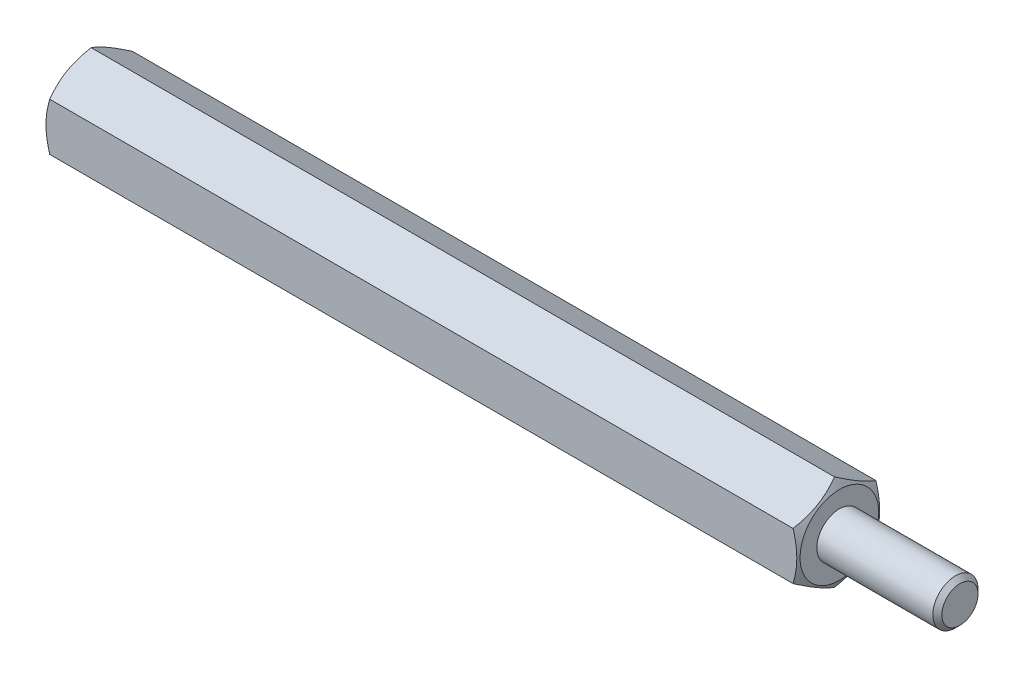
ISO-10303-21;
HEADER;
FILE_DESCRIPTION(('STEP AP214'),'2;1');
FILE_NAME('part.step','',(''),(''),'','','');
FILE_SCHEMA(('AUTOMOTIVE_DESIGN { 1 0 10303 214 1 1 1 1 }'));
ENDSEC;
DATA;
#1=APPLICATION_CONTEXT('core data for automotive mechanical design processes');
#2=APPLICATION_PROTOCOL_DEFINITION('international standard','automotive_design',2000,#1);
#3=PRODUCT_CONTEXT('',#1,'mechanical');
#4=PRODUCT('Part','Part','',(#3));
#5=PRODUCT_RELATED_PRODUCT_CATEGORY('part','',(#4));
#6=PRODUCT_DEFINITION_FORMATION('','',#4);
#7=PRODUCT_DEFINITION_CONTEXT('part definition',#1,'design');
#8=PRODUCT_DEFINITION('design','',#6,#7);
#9=PRODUCT_DEFINITION_SHAPE('','',#8);
#10=(LENGTH_UNIT() NAMED_UNIT(*) SI_UNIT(.MILLI.,.METRE.));
#11=(NAMED_UNIT(*) PLANE_ANGLE_UNIT() SI_UNIT($,.RADIAN.));
#12=(NAMED_UNIT(*) SI_UNIT($,.STERADIAN.) SOLID_ANGLE_UNIT());
#13=UNCERTAINTY_MEASURE_WITH_UNIT(LENGTH_MEASURE(1.E-05),#10,'distance_accuracy_value','');
#14=(GEOMETRIC_REPRESENTATION_CONTEXT(3) GLOBAL_UNCERTAINTY_ASSIGNED_CONTEXT((#13)) GLOBAL_UNIT_ASSIGNED_CONTEXT((#10,
#11,#12)) REPRESENTATION_CONTEXT('',''));
#15=CARTESIAN_POINT('',(0.,0.,0.));
#16=DIRECTION('',(0.,0.,1.));
#17=DIRECTION('',(1.,0.,0.));
#18=AXIS2_PLACEMENT_3D('',#15,#16,#17);
#19=CARTESIAN_POINT('',(50.,0.,0.));
#20=DIRECTION('',(1.,0.,0.));
#21=DIRECTION('',(0.,0.,-1.));
#22=AXIS2_PLACEMENT_3D('',#19,#20,#21);
#23=PLANE('',#22);
#24=CARTESIAN_POINT('',(50.,0.,0.));
#25=DIRECTION('',(1.,0.,0.));
#26=DIRECTION('',(0.,0.,-1.));
#27=AXIS2_PLACEMENT_3D('',#24,#25,#26);
#28=CIRCLE('',#27,1.5);
#29=CARTESIAN_POINT('',(50.,0.,-1.5));
#30=VERTEX_POINT('',#29);
#31=EDGE_CURVE('E120',#30,#30,#28,.T.);
#32=ORIENTED_EDGE('',*,*,#31,.F.);
#33=EDGE_LOOP('',(#32));
#34=FACE_BOUND('',#33,.T.);
#35=CARTESIAN_POINT('',(50.,0.,0.));
#36=DIRECTION('',(1.,0.,0.));
#37=DIRECTION('',(0.,0.,-1.));
#38=AXIS2_PLACEMENT_3D('',#35,#36,#37);
#39=CIRCLE('',#38,2.61250000000001);
#40=CARTESIAN_POINT('',(50.,0.,-2.61250000000001));
#41=VERTEX_POINT('',#40);
#42=EDGE_CURVE('E252',#41,#41,#39,.T.);
#43=ORIENTED_EDGE('',*,*,#42,.T.);
#44=EDGE_LOOP('',(#43));
#45=FACE_BOUND('',#44,.T.);
#46=ADVANCED_FACE('F33',(#34,#45),#23,.T.);
#47=CARTESIAN_POINT('',(58.,0.,0.));
#48=DIRECTION('',(-1.,0.,0.));
#49=DIRECTION('',(0.,0.,1.));
#50=AXIS2_PLACEMENT_3D('',#47,#48,#49);
#51=CYLINDRICAL_SURFACE('',#50,1.5);
#52=CARTESIAN_POINT('',(57.7,0.,0.));
#53=DIRECTION('',(1.,0.,0.));
#54=DIRECTION('',(0.,0.,-1.));
#55=AXIS2_PLACEMENT_3D('',#52,#53,#54);
#56=CIRCLE('',#55,1.5);
#57=CARTESIAN_POINT('',(57.7,0.,-1.5));
#58=VERTEX_POINT('',#57);
#59=EDGE_CURVE('E11',#58,#58,#56,.F.);
#60=ORIENTED_EDGE('',*,*,#59,.T.);
#61=EDGE_LOOP('',(#60));
#62=FACE_BOUND('',#61,.T.);
#63=ORIENTED_EDGE('',*,*,#31,.T.);
#64=EDGE_LOOP('',(#63));
#65=FACE_BOUND('',#64,.T.);
#66=ADVANCED_FACE('F229',(#62,#65),#51,.T.);
#67=CARTESIAN_POINT('',(58.,0.,0.));
#68=DIRECTION('',(1.,0.,0.));
#69=DIRECTION('',(0.,0.,-1.));
#70=AXIS2_PLACEMENT_3D('',#67,#68,#69);
#71=PLANE('',#70);
#72=CARTESIAN_POINT('',(58.,0.,0.));
#73=DIRECTION('',(1.,0.,0.));
#74=DIRECTION('',(0.,0.,-1.));
#75=AXIS2_PLACEMENT_3D('',#72,#73,#74);
#76=CIRCLE('',#75,1.20000000000001);
#77=CARTESIAN_POINT('',(58.,0.,-1.20000000000001));
#78=VERTEX_POINT('',#77);
#79=EDGE_CURVE('E41',#78,#78,#76,.T.);
#80=ORIENTED_EDGE('',*,*,#79,.T.);
#81=EDGE_LOOP('',(#80));
#82=FACE_BOUND('',#81,.T.);
#83=ADVANCED_FACE('F152',(#82),#71,.T.);
#84=CARTESIAN_POINT('',(50.,0.,0.));
#85=DIRECTION('',(-1.,0.,0.));
#86=DIRECTION('',(0.,0.,1.));
#87=AXIS2_PLACEMENT_3D('',#84,#85,#86);
#88=CONICAL_SURFACE('',#87,2.61250000000001,1.0471975511966);
#89=ORIENTED_EDGE('',*,*,#42,.F.);
#90=EDGE_LOOP('',(#89));
#91=FACE_BOUND('',#90,.T.);
#92=CARTESIAN_POINT('',(49.6749275746217,1.58759777021764,-2.7502));
#93=CARTESIAN_POINT('',(49.7152266757372,1.65737010029699,-2.62935077934009));
#94=CARTESIAN_POINT('',(49.7518774353888,1.72774469983534,-2.50745839737736));
#95=CARTESIAN_POINT('',(49.8158521550166,1.86971254687003,-2.2615628732721));
#96=CARTESIAN_POINT('',(49.8431534823119,1.94130831721583,-2.13755536142614));
#97=CARTESIAN_POINT('',(49.8856525926923,2.08361254889599,-1.89107720202405));
#98=CARTESIAN_POINT('',(49.901133219364,2.15429911309864,-1.76864448141258));
#99=CARTESIAN_POINT('',(49.9196149406165,2.29600490065923,-1.52320285763108));
#100=CARTESIAN_POINT('',(49.9226313385238,2.36702360884404,-1.40019484676708));
#101=CARTESIAN_POINT('',(49.9163611925579,2.49972966594897,-1.1703412133892));
#102=CARTESIAN_POINT('',(49.9086141837097,2.56143686540073,-1.06346120874597));
#103=CARTESIAN_POINT('',(49.8840591569221,2.68444923614047,-0.850397532665245));
#104=CARTESIAN_POINT('',(49.8672427483359,2.74575398185008,-0.744214598351105));
#105=CARTESIAN_POINT('',(49.8252024156405,2.86902004703207,-0.530711510606811));
#106=CARTESIAN_POINT('',(49.7998002572992,2.93096576264319,-0.42341838385714));
#107=CARTESIAN_POINT('',(49.7421471121465,3.05393320806134,-0.210432520715945));
#108=CARTESIAN_POINT('',(49.7099096746875,3.11495651365995,-0.104737054973344));
#109=CARTESIAN_POINT('',(49.6749275746217,3.17554195059678,0.000200000000003022));
#110=B_SPLINE_CURVE_WITH_KNOTS('',3,(#92,#93,#94,#95,#96,#97,#98,#99,#100,#101,#102,#103,#104,
#105,#106,#107,#108,#109),.UNSPECIFIED.,.F.,.F.,(4,2,2,2,2,2,2,2,4),(0.,0.435912828725887,
0.872873557116332,1.29901931904671,1.72464171213574,2.09526089052938,2.46622354066374,
2.84541551798557,3.22386274754524),.UNSPECIFIED.);
#111=CARTESIAN_POINT('',(49.6749942449246,1.58771324027148,-2.75));
#112=VERTEX_POINT('',#111);
#113=CARTESIAN_POINT('',(49.6749942449246,3.17542648054294,0.));
#114=VERTEX_POINT('',#113);
#115=EDGE_CURVE('E131',#112,#114,#110,.T.);
#116=ORIENTED_EDGE('',*,*,#115,.T.);
#117=CARTESIAN_POINT('',(49.6749275746217,3.17554195059678,-0.000199999999995645));
#118=CARTESIAN_POINT('',(49.7152266757372,3.10576962051743,0.12064922065991));
#119=CARTESIAN_POINT('',(49.7518774353888,3.03539502097908,0.242541602622638));
#120=CARTESIAN_POINT('',(49.8158521550166,2.89342717394439,0.488437126727897));
#121=CARTESIAN_POINT('',(49.8431534823119,2.82183140359858,0.612444638573861));
#122=CARTESIAN_POINT('',(49.8856525926923,2.67952717191843,0.858922797975949));
#123=CARTESIAN_POINT('',(49.901133219364,2.60884060771577,0.981355518587423));
#124=CARTESIAN_POINT('',(49.9196149406165,2.46713482015519,1.22679714236892));
#125=CARTESIAN_POINT('',(49.9226313385238,2.39611611197038,1.34980515323292));
#126=CARTESIAN_POINT('',(49.9163611925579,2.26341005486544,1.5796587866108));
#127=CARTESIAN_POINT('',(49.9086141837097,2.20170285541369,1.68653879125403));
#128=CARTESIAN_POINT('',(49.8840591569221,2.07869048467395,1.89960246733475));
#129=CARTESIAN_POINT('',(49.8672427483359,2.01738573896434,2.00578540164889));
#130=CARTESIAN_POINT('',(49.8252024156405,1.89411967378235,2.21928848939319));
#131=CARTESIAN_POINT('',(49.7998002572992,1.83217395817123,2.32658161614286));
#132=CARTESIAN_POINT('',(49.7421471121465,1.70920651275308,2.53956747928405));
#133=CARTESIAN_POINT('',(49.7099096746875,1.64818320715446,2.64526294502665));
#134=CARTESIAN_POINT('',(49.6749275746217,1.58759777021764,2.7502));
#135=B_SPLINE_CURVE_WITH_KNOTS('',3,(#117,#118,#119,#120,#121,#122,#123,#124,#125,#126,#127,
#128,#129,#130,#131,#132,#133,#134),.UNSPECIFIED.,.F.,.F.,(4,2,2,2,2,2,2,2,4),(0.,
0.435912828725887,0.872873557116332,1.29901931904672,1.72464171213574,2.09526089052937,
2.46622354066374,2.84541551798557,3.22386274754524),.UNSPECIFIED.);
#136=CARTESIAN_POINT('',(49.6749942449246,1.58771324027147,2.75));
#137=VERTEX_POINT('',#136);
#138=EDGE_CURVE('E139',#114,#137,#135,.T.);
#139=ORIENTED_EDGE('',*,*,#138,.T.);
#140=CARTESIAN_POINT('',(48.5576319326316,-4.30782014241011,2.75));
#141=CARTESIAN_POINT('',(48.6162836095867,-4.18726531654581,2.75));
#142=CARTESIAN_POINT('',(48.6743849240466,-4.06643816910979,2.75));
#143=CARTESIAN_POINT('',(48.7891778669407,-3.8240944166195,2.75));
#144=CARTESIAN_POINT('',(48.8458692806511,-3.70257770996671,2.75));
#145=CARTESIAN_POINT('',(48.9578090560797,-3.458105356063,2.75));
#146=CARTESIAN_POINT('',(49.0130482619427,-3.33514550230564,2.75));
#147=CARTESIAN_POINT('',(49.1213204698911,-3.08826186435015,2.75));
#148=CARTESIAN_POINT('',(49.1743535739049,-2.96433812500113,2.75));
#149=CARTESIAN_POINT('',(49.2792921273943,-2.7113269404381,2.75));
#150=CARTESIAN_POINT('',(49.3311065567683,-2.58220154142924,2.75));
#151=CARTESIAN_POINT('',(49.430916990516,-2.32245648864391,2.75));
#152=CARTESIAN_POINT('',(49.4789125727853,-2.19183667150655,2.75));
#153=CARTESIAN_POINT('',(49.5698579692354,-1.92912498594656,2.75));
#154=CARTESIAN_POINT('',(49.6128175918125,-1.79703654670007,2.75));
#155=CARTESIAN_POINT('',(49.6923417781181,-1.53096629694382,2.75));
#156=CARTESIAN_POINT('',(49.7289083094407,-1.39698508274037,2.75));
#157=CARTESIAN_POINT('',(49.7937438460925,-1.12772708047234,2.75));
#158=CARTESIAN_POINT('',(49.8220547897378,-0.992460577616631,2.75));
#159=CARTESIAN_POINT('',(49.8687813176856,-0.720203153927685,2.75));
#160=CARTESIAN_POINT('',(49.8871980675805,-0.583212438163358,2.75));
#161=CARTESIAN_POINT('',(49.9124291314624,-0.309989978008801,2.75));
#162=CARTESIAN_POINT('',(49.9193954911205,-0.17377262999625,2.75));
#163=CARTESIAN_POINT('',(49.9215379629552,0.0987726794769197,2.75));
#164=CARTESIAN_POINT('',(49.9167134971984,0.235100646032144,2.75));
#165=CARTESIAN_POINT('',(49.8989680753535,0.465158037199999,2.75));
#166=CARTESIAN_POINT('',(49.8889841108657,0.559128814459647,2.75));
#167=CARTESIAN_POINT('',(49.8640111201075,0.746408748148825,2.75));
#168=CARTESIAN_POINT('',(49.8490213815566,0.839717808490765,2.75));
#169=CARTESIAN_POINT('',(49.7973222369876,1.11853931619131,2.75));
#170=CARTESIAN_POINT('',(49.7538938441819,1.30282115121641,2.75));
#171=CARTESIAN_POINT('',(49.6782135831305,1.5786792582721,2.75));
#172=CARTESIAN_POINT('',(49.6508277417716,1.67167174830885,2.75));
#173=CARTESIAN_POINT('',(49.5931453490653,1.85669755112827,2.75));
#174=CARTESIAN_POINT('',(49.562850519184,1.94873139590001,2.75));
#175=CARTESIAN_POINT('',(49.4998214739185,2.13194851920638,2.75));
#176=CARTESIAN_POINT('',(49.4670873446708,2.22313182764733,2.75));
#177=CARTESIAN_POINT('',(49.3995759688816,2.40475072200258,2.75));
#178=CARTESIAN_POINT('',(49.3647984472483,2.49518620536279,2.75));
#179=CARTESIAN_POINT('',(49.286074979109,2.69425906745494,2.75));
#180=CARTESIAN_POINT('',(49.2417347386106,2.8027401541903,2.75));
#181=CARTESIAN_POINT('',(49.1510337491748,3.01885617108242,2.75));
#182=CARTESIAN_POINT('',(49.1046729095401,3.12649106300008,2.75));
#183=CARTESIAN_POINT('',(48.9631220023641,3.44835421203614,2.75));
#184=CARTESIAN_POINT('',(48.865478930226,3.6615028537882,2.75));
#185=CARTESIAN_POINT('',(48.6657085844919,4.0858235012659,2.75));
#186=CARTESIAN_POINT('',(48.5635786539451,4.29699424346804,2.75));
#187=CARTESIAN_POINT('',(48.3561807980291,4.71779425640231,2.75));
#188=CARTESIAN_POINT('',(48.2509127618966,4.92742347239814,2.75));
#189=CARTESIAN_POINT('',(48.037845903081,5.34602646409933,2.75));
#190=CARTESIAN_POINT('',(47.9300415771346,5.55499742988841,2.75));
#191=CARTESIAN_POINT('',(47.7127213552635,5.97205161125948,2.75));
#192=CARTESIAN_POINT('',(47.6032054225523,6.18013480763858,2.75));
#193=CARTESIAN_POINT('',(47.2728160121337,6.80319050465919,2.75));
#194=CARTESIAN_POINT('',(47.0500134395911,7.21713914846338,2.75));
#195=CARTESIAN_POINT('',(46.6349320787507,7.98131294129821,2.75));
#196=CARTESIAN_POINT('',(46.443091202704,8.33177707266852,2.75));
#197=CARTESIAN_POINT('',(46.0577699675954,9.03185646098385,2.75));
#198=CARTESIAN_POINT('',(45.8642894185863,9.38147161337288,2.75));
#199=CARTESIAN_POINT('',(45.4770176449484,10.0785196333477,2.75));
#200=CARTESIAN_POINT('',(45.2832315222264,10.425955339249,2.75));
#201=CARTESIAN_POINT('',(44.8948017372515,11.1202888046247,2.75));
#202=CARTESIAN_POINT('',(44.7001581879707,11.4671866272798,2.75));
#203=CARTESIAN_POINT('',(44.5052089419494,11.8139117951099,2.75));
#204=B_SPLINE_CURVE_WITH_KNOTS('',3,(#140,#141,#142,#143,#144,#145,#146,#147,#148,#149,#150,
#151,#152,#153,#154,#155,#156,#157,#158,#159,#160,#161,#162,#163,#164,#165,#166,#167,#168,#169,
#170,#171,#172,#173,#174,#175,#176,#177,#178,#179,#180,#181,#182,#183,#184,#185,#186,#187,#188,
#189,#190,#191,#192,#193,#194,#195,#196,#197,#198,#199,#200,#201,#202,#203),.UNSPECIFIED.,.F.,
.F.,(4,2,2,2,2,2,2,2,2,2,2,2,2,2,2,2,2,2,2,2,2,2,2,2,2,2,2,2,2,2,2,4),(0.,0.402200406174207,
0.804461695776018,1.20883826557492,1.61319613116903,2.03054962807289,2.44794919196405,
2.86452179433193,3.28096596207104,3.69525619374118,4.10949760895259,4.51819266601271,
4.92690775587315,5.21027047572885,5.49367353296155,6.06085418548303,6.35165161864581,
6.64227801348786,6.93289415059065,7.22354950196185,7.57510236122624,7.92667101670864,
8.62993150186774,9.333614197965,10.0373217608381,10.7427306430188,11.4481547069671,
12.8584292219797,14.0570297519007,15.255771084781,16.4492444189717,17.6425649463424),.UNSPECIFIED.);
#205=CARTESIAN_POINT('',(49.6749942449246,-1.58771324027147,2.75));
#206=VERTEX_POINT('',#205);
#207=EDGE_CURVE('E179',#137,#206,#204,.F.);
#208=ORIENTED_EDGE('',*,*,#207,.T.);
#209=CARTESIAN_POINT('',(49.6749275746217,-1.58759777021763,2.7502));
#210=CARTESIAN_POINT('',(49.7152266757372,-1.65737010029699,2.62935077934009));
#211=CARTESIAN_POINT('',(49.7518774353888,-1.72774469983533,2.50745839737736));
#212=CARTESIAN_POINT('',(49.8158521550166,-1.86971254687003,2.26156287327211));
#213=CARTESIAN_POINT('',(49.8431534823119,-1.94130831721583,2.13755536142614));
#214=CARTESIAN_POINT('',(49.8856525926923,-2.08361254889599,1.89107720202406));
#215=CARTESIAN_POINT('',(49.901133219364,-2.15429911309864,1.76864448141258));
#216=CARTESIAN_POINT('',(49.9196149406165,-2.29600490065923,1.52320285763108));
#217=CARTESIAN_POINT('',(49.9226313385238,-2.36702360884404,1.40019484676709));
#218=CARTESIAN_POINT('',(49.9163611925579,-2.49972966594897,1.1703412133892));
#219=CARTESIAN_POINT('',(49.9086141837097,-2.56143686540073,1.06346120874598));
#220=CARTESIAN_POINT('',(49.8840591569221,-2.68444923614047,0.850397532665247));
#221=CARTESIAN_POINT('',(49.8672427483359,-2.74575398185008,0.744214598351108));
#222=CARTESIAN_POINT('',(49.8252024156405,-2.86902004703207,0.530711510606812));
#223=CARTESIAN_POINT('',(49.7998002572992,-2.93096576264319,0.423418383857141));
#224=CARTESIAN_POINT('',(49.7421471121465,-3.05393320806134,0.210432520715944));
#225=CARTESIAN_POINT('',(49.7099096746875,-3.11495651365995,0.104737054973342));
#226=CARTESIAN_POINT('',(49.6749275746217,-3.17554195059678,-0.000200000000004793));
#227=B_SPLINE_CURVE_WITH_KNOTS('',3,(#209,#210,#211,#212,#213,#214,#215,#216,#217,#218,#219,
#220,#221,#222,#223,#224,#225,#226),.UNSPECIFIED.,.F.,.F.,(4,2,2,2,2,2,2,2,4),(0.,
0.435912828725886,0.872873557116331,1.29901931904671,1.72464171213574,2.09526089052938,
2.46622354066375,2.84541551798557,3.22386274754525),.UNSPECIFIED.);
#228=CARTESIAN_POINT('',(49.6749942449246,-3.17542648054294,0.));
#229=VERTEX_POINT('',#228);
#230=EDGE_CURVE('E174',#206,#229,#227,.T.);
#231=ORIENTED_EDGE('',*,*,#230,.T.);
#232=CARTESIAN_POINT('',(49.6749275746217,-3.17554195059678,0.000199999999994542));
#233=CARTESIAN_POINT('',(49.7152266757372,-3.10576962051743,-0.120649220659911));
#234=CARTESIAN_POINT('',(49.7518774353888,-3.03539502097908,-0.242541602622639));
#235=CARTESIAN_POINT('',(49.8158521550166,-2.89342717394439,-0.488437126727897));
#236=CARTESIAN_POINT('',(49.8431534823119,-2.82183140359859,-0.61244463857386));
#237=CARTESIAN_POINT('',(49.8856525926923,-2.67952717191843,-0.858922797975949));
#238=CARTESIAN_POINT('',(49.901133219364,-2.60884060771577,-0.981355518587423));
#239=CARTESIAN_POINT('',(49.9196149406165,-2.46713482015519,-1.22679714236892));
#240=CARTESIAN_POINT('',(49.9226313385238,-2.39611611197038,-1.34980515323292));
#241=CARTESIAN_POINT('',(49.9163611925579,-2.26341005486544,-1.5796587866108));
#242=CARTESIAN_POINT('',(49.9086141837097,-2.20170285541369,-1.68653879125403));
#243=CARTESIAN_POINT('',(49.8840591569221,-2.07869048467395,-1.89960246733475));
#244=CARTESIAN_POINT('',(49.8672427483359,-2.01738573896434,-2.00578540164889));
#245=CARTESIAN_POINT('',(49.8252024156405,-1.89411967378235,-2.21928848939318));
#246=CARTESIAN_POINT('',(49.7998002572992,-1.83217395817123,-2.32658161614286));
#247=CARTESIAN_POINT('',(49.7421471121465,-1.70920651275308,-2.53956747928405));
#248=CARTESIAN_POINT('',(49.7099096746875,-1.64818320715447,-2.64526294502665));
#249=CARTESIAN_POINT('',(49.6749275746217,-1.58759777021764,-2.7502));
#250=B_SPLINE_CURVE_WITH_KNOTS('',3,(#232,#233,#234,#235,#236,#237,#238,#239,#240,#241,#242,
#243,#244,#245,#246,#247,#248,#249),.UNSPECIFIED.,.F.,.F.,(4,2,2,2,2,2,2,2,4),(0.,
0.435912828725886,0.87287355711633,1.29901931904671,1.72464171213574,2.09526089052937,
2.46622354066374,2.84541551798556,3.22386274754523),.UNSPECIFIED.);
#251=CARTESIAN_POINT('',(49.6749942449246,-1.58771324027148,-2.75));
#252=VERTEX_POINT('',#251);
#253=EDGE_CURVE('E48',#229,#252,#250,.T.);
#254=ORIENTED_EDGE('',*,*,#253,.T.);
#255=CARTESIAN_POINT('',(48.5576319321002,-4.30782014350211,-2.75));
#256=CARTESIAN_POINT('',(48.6162836090775,-4.18726531760098,-2.75));
#257=CARTESIAN_POINT('',(48.6743849235596,-4.06643817012811,-2.75));
#258=CARTESIAN_POINT('',(48.789177866498,-3.824094417564,-2.75));
#259=CARTESIAN_POINT('',(48.8458692802305,-3.70257771087424,-2.75));
#260=CARTESIAN_POINT('',(48.9578090557033,-3.45810535689603,-2.75));
#261=CARTESIAN_POINT('',(49.0130482615885,-3.33514550310114,-2.75));
#262=CARTESIAN_POINT('',(49.1213204695807,-3.08826186507032,-2.75));
#263=CARTESIAN_POINT('',(49.1743535736162,-2.9643381256835,-2.75));
#264=CARTESIAN_POINT('',(49.2792921271496,-2.71132694104215,-2.75));
#265=CARTESIAN_POINT('',(49.3311065565458,-2.58220154199273,-2.75));
#266=CARTESIAN_POINT('',(49.4309169903368,-2.32245648912563,-2.75));
#267=CARTESIAN_POINT('',(49.4789125726271,-2.19183667194707,-2.75));
#268=CARTESIAN_POINT('',(49.5698579691173,-1.9291249863039,-2.75));
#269=CARTESIAN_POINT('',(49.6128175917135,-1.79703654701544,-2.75));
#270=CARTESIAN_POINT('',(49.692341778054,-1.53096629717411,-2.75));
#271=CARTESIAN_POINT('',(49.7289083093926,-1.39698508292755,-2.75));
#272=CARTESIAN_POINT('',(49.7937438460766,-1.12772708055107,-2.75));
#273=CARTESIAN_POINT('',(49.8220547897369,-0.992460577629729,-2.75));
#274=CARTESIAN_POINT('',(49.8687813177048,-0.720203153807918,-2.75));
#275=CARTESIAN_POINT('',(49.8871980676048,-0.583212437976368,-2.75));
#276=CARTESIAN_POINT('',(49.912429131485,-0.309989977688433,-2.75));
#277=CARTESIAN_POINT('',(49.9193954911365,-0.173772629609738,-2.75));
#278=CARTESIAN_POINT('',(49.9215379629464,0.098772679994709,-2.75));
#279=CARTESIAN_POINT('',(49.9167134971714,0.235100646615068,-2.75));
#280=CARTESIAN_POINT('',(49.8989680752898,0.465158037864659,-2.75));
#281=CARTESIAN_POINT('',(49.8889841107875,0.559128815141645,-2.75));
#282=CARTESIAN_POINT('',(49.8640111199994,0.746408748864726,-2.75));
#283=CARTESIAN_POINT('',(49.8490213814332,0.83971780922323,-2.75));
#284=CARTESIAN_POINT('',(49.797322236818,1.11853931697259,-2.75));
#285=CARTESIAN_POINT('',(49.7538938439809,1.30282115202896,-2.75));
#286=CARTESIAN_POINT('',(49.6782135828835,1.57867925913149,-2.75));
#287=CARTESIAN_POINT('',(49.6508277415091,1.67167174918423,-2.75));
#288=CARTESIAN_POINT('',(49.5931453487722,1.85669755203541,-2.75));
#289=CARTESIAN_POINT('',(49.5628505188759,1.94873139682294,-2.75));
#290=CARTESIAN_POINT('',(49.4998214735808,2.13194852016076,-2.75));
#291=CARTESIAN_POINT('',(49.4670873443186,2.22313182861738,-2.75));
#292=CARTESIAN_POINT('',(49.399575968501,2.40475072300398,-2.75));
#293=CARTESIAN_POINT('',(49.3647984468537,2.49518620637986,-2.75));
#294=CARTESIAN_POINT('',(49.2860749786937,2.69425906848207,-2.75));
#295=CARTESIAN_POINT('',(49.2417347381892,2.80274015521204,-2.74999999999999));
#296=CARTESIAN_POINT('',(49.1510337487429,3.01885617209384,-2.74999999999999));
#297=CARTESIAN_POINT('',(49.1046729091036,3.12649106400655,-2.74999999999999));
#298=CARTESIAN_POINT('',(48.9631220019155,3.44835421302832,-2.74999999999999));
#299=CARTESIAN_POINT('',(48.8654789297715,3.66150285477161,-2.74999999999999));
#300=CARTESIAN_POINT('',(48.6657085840283,4.08582350223269,-2.74999999999999));
#301=CARTESIAN_POINT('',(48.5635786534785,4.29699424442699,-2.74999999999999));
#302=CARTESIAN_POINT('',(48.3561807975579,4.71779425734633,-2.74999999999999));
#303=CARTESIAN_POINT('',(48.2509127614241,4.92742347333506,-2.74999999999999));
#304=CARTESIAN_POINT('',(48.0378459026071,5.34602646502204,-2.74999999999999));
#305=CARTESIAN_POINT('',(47.9300415766607,5.55499743080399,-2.74999999999999));
#306=CARTESIAN_POINT('',(47.7127213547904,5.9720516121612,-2.74999999999999));
#307=CARTESIAN_POINT('',(47.6032054220802,6.18013480853355,-2.74999999999999));
#308=CARTESIAN_POINT('',(47.2728160116647,6.80319050553457,-2.74999999999999));
#309=CARTESIAN_POINT('',(47.0500134391252,7.21713914932634,-2.74999999999999));
#310=CARTESIAN_POINT('',(46.6349320782842,7.98131294215254,-2.74999999999999));
#311=CARTESIAN_POINT('',(46.4430912022335,8.33177707352653,-2.74999999999999));
#312=CARTESIAN_POINT('',(46.0577699671173,9.03185646184938,-2.74999999999999));
#313=CARTESIAN_POINT('',(45.8642894181045,9.38147161424224,-2.74999999999999));
#314=CARTESIAN_POINT('',(45.4770176444589,10.0785196342265,-2.74999999999999));
#315=CARTESIAN_POINT('',(45.2832315217327,10.4259553401334,-2.74999999999999));
#316=CARTESIAN_POINT('',(44.8948017367494,11.1202888055205,-2.74999999999999));
#317=CARTESIAN_POINT('',(44.7001581874645,11.4671866281813,-2.74999999999999));
#318=CARTESIAN_POINT('',(44.5052089414391,11.8139117960172,-2.74999999999999));
#319=B_SPLINE_CURVE_WITH_KNOTS('',3,(#255,#256,#257,#258,#259,#260,#261,#262,#263,#264,#265,
#266,#267,#268,#269,#270,#271,#272,#273,#274,#275,#276,#277,#278,#279,#280,#281,#282,#283,#284,
#285,#286,#287,#288,#289,#290,#291,#292,#293,#294,#295,#296,#297,#298,#299,#300,#301,#302,#303,
#304,#305,#306,#307,#308,#309,#310,#311,#312,#313,#314,#315,#316,#317,#318),.UNSPECIFIED.,.F.,
.F.,(4,2,2,2,2,2,2,2,2,2,2,2,2,2,2,2,2,2,2,2,2,2,2,2,2,2,2,2,2,2,2,4),(0.,0.402200406302724,
0.80446169603307,1.20883826596186,1.61319613168587,2.03054962872746,2.4479491927564,
2.8645217952616,3.28096596313794,3.69525619500961,4.10949761042227,4.51819266767878,
4.92690775773571,5.21027047764773,5.49367353493676,6.06085418757122,6.35165162079317,
6.64227801569431,6.93289415285606,7.22354950428624,7.57510236354253,7.92667101901679,
8.62993150415944,9.33361420023961,10.0373217630956,10.7427306452573,11.4481547091865,
12.8584292241618,14.0570297540983,15.2557710869939,16.4492444212054,17.6425649485972),.UNSPECIFIED.);
#320=EDGE_CURVE('E104',#252,#112,#319,.T.);
#321=ORIENTED_EDGE('',*,*,#320,.T.);
#322=EDGE_LOOP('',(#116,#139,#208,#231,#254,#321));
#323=FACE_BOUND('',#322,.T.);
#324=ADVANCED_FACE('F147',(#91,#323),#88,.T.);
#325=CARTESIAN_POINT('',(50.,-1.58771324027148,-2.75));
#326=DIRECTION('',(0.,0.,1.));
#327=DIRECTION('',(0.,-1.,0.));
#328=AXIS2_PLACEMENT_3D('',#325,#326,#327);
#329=PLANE('',#328);
#330=DIRECTION('',(-1.,0.,0.));
#331=VECTOR('',#330,1.);
#332=CARTESIAN_POINT('',(50.,-1.58771324027148,-2.75));
#333=LINE('',#332,#331);
#334=CARTESIAN_POINT('',(0.325005755075304,-1.58771324027167,-2.75));
#335=VERTEX_POINT('',#334);
#336=EDGE_CURVE('E98',#252,#335,#333,.T.);
#337=ORIENTED_EDGE('',*,*,#336,.T.);
#338=CARTESIAN_POINT('',(1.44236806789984,-4.30782014350212,-2.75));
#339=CARTESIAN_POINT('',(1.38371639092254,-4.18726531760099,-2.75));
#340=CARTESIAN_POINT('',(1.32561507644045,-4.06643817012812,-2.75));
#341=CARTESIAN_POINT('',(1.21082213350203,-3.824094417564,-2.75));
#342=CARTESIAN_POINT('',(1.15413071976949,-3.70257771087424,-2.75));
#343=CARTESIAN_POINT('',(1.04219094429671,-3.45810535689603,-2.75));
#344=CARTESIAN_POINT('',(0.98695173841154,-3.33514550310114,-2.75));
#345=CARTESIAN_POINT('',(0.878679530419349,-3.08826186507032,-2.75));
#346=CARTESIAN_POINT('',(0.825646426383825,-2.9643381256835,-2.75));
#347=CARTESIAN_POINT('',(0.720707872850375,-2.71132694104215,-2.75));
#348=CARTESIAN_POINT('',(0.668893443454169,-2.58220154199273,-2.75));
#349=CARTESIAN_POINT('',(0.56908300966316,-2.32245648912563,-2.75));
#350=CARTESIAN_POINT('',(0.521087427372889,-2.19183667194707,-2.75));
#351=CARTESIAN_POINT('',(0.430142030882725,-1.9291249863039,-2.75));
#352=CARTESIAN_POINT('',(0.387182408286516,-1.79703654701544,-2.75));
#353=CARTESIAN_POINT('',(0.307658221946016,-1.53096629717411,-2.75));
#354=CARTESIAN_POINT('',(0.271091690607389,-1.39698508292755,-2.75));
#355=CARTESIAN_POINT('',(0.206256153923405,-1.12772708055107,-2.75));
#356=CARTESIAN_POINT('',(0.17794521026309,-0.992460577629727,-2.75));
#357=CARTESIAN_POINT('',(0.131218682295206,-0.720203153807916,-2.75));
#358=CARTESIAN_POINT('',(0.11280193239521,-0.583212437976367,-2.75));
#359=CARTESIAN_POINT('',(0.087570868514987,-0.309989977688431,-2.75));
#360=CARTESIAN_POINT('',(0.0806045088634958,-0.173772629609737,-2.75));
#361=CARTESIAN_POINT('',(0.078462037053641,0.0987726799947109,-2.75));
#362=CARTESIAN_POINT('',(0.0832865028286562,0.23510064661507,-2.75));
#363=CARTESIAN_POINT('',(0.101031924710265,0.465158037864661,-2.75));
#364=CARTESIAN_POINT('',(0.111015889212559,0.559128815141647,-2.75));
#365=CARTESIAN_POINT('',(0.135988880000603,0.746408748864728,-2.75));
#366=CARTESIAN_POINT('',(0.150978618566838,0.839717809223232,-2.75));
#367=CARTESIAN_POINT('',(0.20267776318206,1.1185393169726,-2.75));
#368=CARTESIAN_POINT('',(0.246106156019073,1.30282115202896,-2.75));
#369=CARTESIAN_POINT('',(0.321786417116547,1.57867925913149,-2.75));
#370=CARTESIAN_POINT('',(0.349172258490935,1.67167174918423,-2.75));
#371=CARTESIAN_POINT('',(0.406854651227838,1.85669755203541,-2.75));
#372=CARTESIAN_POINT('',(0.437149481124149,1.94873139682294,-2.75));
#373=CARTESIAN_POINT('',(0.500178526419205,2.13194852016076,-2.75));
#374=CARTESIAN_POINT('',(0.532912655681421,2.22313182861738,-2.75));
#375=CARTESIAN_POINT('',(0.600424031499047,2.40475072300398,-2.75));
#376=CARTESIAN_POINT('',(0.635201553146344,2.49518620637986,-2.75));
#377=CARTESIAN_POINT('',(0.713925021306319,2.69425906848207,-2.75));
#378=CARTESIAN_POINT('',(0.75826526181078,2.80274015521204,-2.74999999999999));
#379=CARTESIAN_POINT('',(0.848966251257138,3.01885617209384,-2.74999999999999));
#380=CARTESIAN_POINT('',(0.895327090896407,3.12649106400656,-2.74999999999999));
#381=CARTESIAN_POINT('',(1.03687799808455,3.44835421302832,-2.74999999999999));
#382=CARTESIAN_POINT('',(1.13452107022851,3.66150285477161,-2.74999999999999));
#383=CARTESIAN_POINT('',(1.33429141597171,4.08582350223269,-2.74999999999999));
#384=CARTESIAN_POINT('',(1.43642134652157,4.29699424442699,-2.74999999999999));
#385=CARTESIAN_POINT('',(1.64381920244215,4.71779425734633,-2.74999999999999));
#386=CARTESIAN_POINT('',(1.74908723857596,4.92742347333506,-2.74999999999999));
#387=CARTESIAN_POINT('',(1.96215409739296,5.34602646502203,-2.74999999999999));
#388=CARTESIAN_POINT('',(2.06995842333932,5.55499743080399,-2.74999999999999));
#389=CARTESIAN_POINT('',(2.28727864520958,5.97205161216119,-2.74999999999999));
#390=CARTESIAN_POINT('',(2.39679457791986,6.18013480853355,-2.74999999999999));
#391=CARTESIAN_POINT('',(2.7271839883353,6.80319050553457,-2.74999999999999));
#392=CARTESIAN_POINT('',(2.94998656087477,7.21713914932633,-2.74999999999999));
#393=CARTESIAN_POINT('',(3.36506792171577,7.98131294215254,-2.74999999999999));
#394=CARTESIAN_POINT('',(3.55690879776654,8.33177707352653,-2.74999999999999));
#395=CARTESIAN_POINT('',(3.94223003288275,9.03185646184938,-2.74999999999999));
#396=CARTESIAN_POINT('',(4.13571058189547,9.38147161424225,-2.74999999999999));
#397=CARTESIAN_POINT('',(4.52298235554117,10.0785196342265,-2.74999999999999));
#398=CARTESIAN_POINT('',(4.71676847826737,10.4259553401334,-2.74999999999999));
#399=CARTESIAN_POINT('',(5.1051982632506,11.1202888055205,-2.74999999999999));
#400=CARTESIAN_POINT('',(5.29984181253548,11.4671866281813,-2.74999999999999));
#401=CARTESIAN_POINT('',(5.49479105856088,11.8139117960173,-2.74999999999999));
#402=B_SPLINE_CURVE_WITH_KNOTS('',3,(#338,#339,#340,#341,#342,#343,#344,#345,#346,#347,#348,
#349,#350,#351,#352,#353,#354,#355,#356,#357,#358,#359,#360,#361,#362,#363,#364,#365,#366,#367,
#368,#369,#370,#371,#372,#373,#374,#375,#376,#377,#378,#379,#380,#381,#382,#383,#384,#385,#386,
#387,#388,#389,#390,#391,#392,#393,#394,#395,#396,#397,#398,#399,#400,#401),.UNSPECIFIED.,.F.,
.F.,(4,2,2,2,2,2,2,2,2,2,2,2,2,2,2,2,2,2,2,2,2,2,2,2,2,2,2,2,2,2,2,4),(0.,0.402200406302722,
0.804461696033069,1.20883826596187,1.61319613168587,2.03054962872746,2.44794919275641,
2.86452179526161,3.28096596313794,3.69525619500962,4.10949761042228,4.51819266767879,
4.92690775773572,5.21027047764774,5.49367353493677,6.06085418757123,6.35165162079318,
6.64227801569432,6.93289415285606,7.22354950428625,7.57510236354254,7.9266710190168,
8.62993150415945,9.33361420023962,10.0373217630956,10.7427306452573,11.4481547091865,
12.8584292241618,14.0570297540983,15.2557710869939,16.4492444212055,17.6425649485972),.UNSPECIFIED.);
#403=CARTESIAN_POINT('',(0.325005755075435,1.58771324027148,-2.75));
#404=VERTEX_POINT('',#403);
#405=EDGE_CURVE('E83',#335,#404,#402,.T.);
#406=ORIENTED_EDGE('',*,*,#405,.T.);
#407=DIRECTION('',(-1.,0.,0.));
#408=VECTOR('',#407,1.);
#409=CARTESIAN_POINT('',(50.,1.58771324027148,-2.75));
#410=LINE('',#409,#408);
#411=EDGE_CURVE('E105',#112,#404,#410,.T.);
#412=ORIENTED_EDGE('',*,*,#411,.F.);
#413=ORIENTED_EDGE('',*,*,#320,.F.);
#414=EDGE_LOOP('',(#337,#406,#412,#413));
#415=FACE_BOUND('',#414,.T.);
#416=ADVANCED_FACE('F103',(#415),#329,.F.);
#417=CARTESIAN_POINT('',(50.,-3.17542648054294,0.));
#418=DIRECTION('',(0.,0.866025403784438,0.5));
#419=DIRECTION('',(0.,-0.5,0.866025403784438));
#420=AXIS2_PLACEMENT_3D('',#417,#418,#419);
#421=PLANE('',#420);
#422=DIRECTION('',(-1.,0.,0.));
#423=VECTOR('',#422,1.);
#424=CARTESIAN_POINT('',(50.,-3.17542648054294,0.));
#425=LINE('',#424,#423);
#426=CARTESIAN_POINT('',(0.325005755075438,-3.17542648054294,0.));
#427=VERTEX_POINT('',#426);
#428=EDGE_CURVE('E100',#229,#427,#425,.T.);
#429=ORIENTED_EDGE('',*,*,#428,.T.);
#430=CARTESIAN_POINT('',(0.325072425378336,-3.17554195059678,0.000199999999995148));
#431=CARTESIAN_POINT('',(0.284773324262838,-3.10576962051743,-0.120649220659911));
#432=CARTESIAN_POINT('',(0.248122564611237,-3.03539502097908,-0.242541602622639));
#433=CARTESIAN_POINT('',(0.184147844983376,-2.89342717394439,-0.488437126727898));
#434=CARTESIAN_POINT('',(0.156846517688073,-2.82183140359859,-0.612444638573861));
#435=CARTESIAN_POINT('',(0.114347407307692,-2.67952717191843,-0.85892279797595));
#436=CARTESIAN_POINT('',(0.0988667806360331,-2.60884060771577,-0.981355518587423));
#437=CARTESIAN_POINT('',(0.0803850593835159,-2.46713482015519,-1.22679714236892));
#438=CARTESIAN_POINT('',(0.0773686614761752,-2.39611611197038,-1.34980515323292));
#439=CARTESIAN_POINT('',(0.0836388074421224,-2.26341005486544,-1.5796587866108));
#440=CARTESIAN_POINT('',(0.0913858162902782,-2.20170285541369,-1.68653879125403));
#441=CARTESIAN_POINT('',(0.115940843077931,-2.07869048467395,-1.89960246733475));
#442=CARTESIAN_POINT('',(0.132757251664146,-2.01738573896434,-2.00578540164889));
#443=CARTESIAN_POINT('',(0.174797584359532,-1.89411967378235,-2.21928848939318));
#444=CARTESIAN_POINT('',(0.200199742700806,-1.83217395817123,-2.32658161614285));
#445=CARTESIAN_POINT('',(0.257852887853556,-1.70920651275308,-2.53956747928405));
#446=CARTESIAN_POINT('',(0.290090325312557,-1.64818320715447,-2.64526294502665));
#447=CARTESIAN_POINT('',(0.325072425378334,-1.58759777021764,-2.7502));
#448=B_SPLINE_CURVE_WITH_KNOTS('',3,(#430,#431,#432,#433,#434,#435,#436,#437,#438,#439,#440,
#441,#442,#443,#444,#445,#446,#447),.UNSPECIFIED.,.F.,.F.,(4,2,2,2,2,2,2,2,4),(0.,
0.435912828725889,0.872873557116333,1.29901931904672,1.72464171213574,2.09526089052938,
2.46622354066374,2.84541551798557,3.22386274754524),.UNSPECIFIED.);
#449=EDGE_CURVE('E86',#427,#335,#448,.T.);
#450=ORIENTED_EDGE('',*,*,#449,.T.);
#451=ORIENTED_EDGE('',*,*,#336,.F.);
#452=ORIENTED_EDGE('',*,*,#253,.F.);
#453=EDGE_LOOP('',(#429,#450,#451,#452));
#454=FACE_BOUND('',#453,.T.);
#455=ADVANCED_FACE('F97',(#454),#421,.F.);
#456=CARTESIAN_POINT('',(50.,-1.58771324027147,2.75));
#457=DIRECTION('',(0.,0.866025403784439,-0.5));
#458=DIRECTION('',(0.,0.5,0.866025403784439));
#459=AXIS2_PLACEMENT_3D('',#456,#457,#458);
#460=PLANE('',#459);
#461=DIRECTION('',(-1.,0.,0.));
#462=VECTOR('',#461,1.);
#463=CARTESIAN_POINT('',(50.,-1.58771324027147,2.75));
#464=LINE('',#463,#462);
#465=CARTESIAN_POINT('',(0.325005755075436,-1.58771324027147,2.75));
#466=VERTEX_POINT('',#465);
#467=EDGE_CURVE('E107',#206,#466,#464,.T.);
#468=ORIENTED_EDGE('',*,*,#467,.T.);
#469=CARTESIAN_POINT('',(0.325072425378334,-1.58759777021763,2.7502));
#470=CARTESIAN_POINT('',(0.284773324262837,-1.65737010029699,2.62935077934009));
#471=CARTESIAN_POINT('',(0.248122564611235,-1.72774469983533,2.50745839737736));
#472=CARTESIAN_POINT('',(0.184147844983374,-1.86971254687003,2.26156287327211));
#473=CARTESIAN_POINT('',(0.156846517688071,-1.94130831721583,2.13755536142614));
#474=CARTESIAN_POINT('',(0.11434740730769,-2.08361254889599,1.89107720202405));
#475=CARTESIAN_POINT('',(0.0988667806360311,-2.15429911309864,1.76864448141258));
#476=CARTESIAN_POINT('',(0.0803850593835137,-2.29600490065923,1.52320285763108));
#477=CARTESIAN_POINT('',(0.077368661476173,-2.36702360884404,1.40019484676709));
#478=CARTESIAN_POINT('',(0.0836388074421202,-2.49972966594897,1.1703412133892));
#479=CARTESIAN_POINT('',(0.0913858162902759,-2.56143686540073,1.06346120874598));
#480=CARTESIAN_POINT('',(0.115940843077929,-2.68444923614047,0.850397532665247));
#481=CARTESIAN_POINT('',(0.132757251664144,-2.74575398185008,0.744214598351108));
#482=CARTESIAN_POINT('',(0.174797584359531,-2.86902004703207,0.530711510606812));
#483=CARTESIAN_POINT('',(0.200199742700805,-2.93096576264319,0.423418383857141));
#484=CARTESIAN_POINT('',(0.257852887853557,-3.05393320806134,0.210432520715944));
#485=CARTESIAN_POINT('',(0.290090325312558,-3.11495651365995,0.104737054973343));
#486=CARTESIAN_POINT('',(0.325072425378336,-3.17554195059678,-0.000200000000004913));
#487=B_SPLINE_CURVE_WITH_KNOTS('',3,(#469,#470,#471,#472,#473,#474,#475,#476,#477,#478,#479,
#480,#481,#482,#483,#484,#485,#486),.UNSPECIFIED.,.F.,.F.,(4,2,2,2,2,2,2,2,4),(0.,
0.435912828725889,0.872873557116333,1.29901931904672,1.72464171213574,2.09526089052938,
2.46622354066375,2.84541551798558,3.22386274754525),.UNSPECIFIED.);
#488=EDGE_CURVE('E101',#466,#427,#487,.T.);
#489=ORIENTED_EDGE('',*,*,#488,.T.);
#490=ORIENTED_EDGE('',*,*,#428,.F.);
#491=ORIENTED_EDGE('',*,*,#230,.F.);
#492=EDGE_LOOP('',(#468,#489,#490,#491));
#493=FACE_BOUND('',#492,.T.);
#494=ADVANCED_FACE('F188',(#493),#460,.F.);
#495=CARTESIAN_POINT('',(50.,1.58771324027147,2.75));
#496=DIRECTION('',(0.,0.,-1.));
#497=DIRECTION('',(-1.,0.,0.));
#498=AXIS2_PLACEMENT_3D('',#495,#496,#497);
#499=PLANE('',#498);
#500=DIRECTION('',(-1.,0.,0.));
#501=VECTOR('',#500,1.);
#502=CARTESIAN_POINT('',(50.,1.58771324027147,2.75));
#503=LINE('',#502,#501);
#504=CARTESIAN_POINT('',(0.325005755075436,1.58771324027147,2.75));
#505=VERTEX_POINT('',#504);
#506=EDGE_CURVE('E115',#137,#505,#503,.T.);
#507=ORIENTED_EDGE('',*,*,#506,.T.);
#508=CARTESIAN_POINT('',(1.44236806736841,-4.30782014241011,2.75));
#509=CARTESIAN_POINT('',(1.38371639041334,-4.18726531654581,2.75));
#510=CARTESIAN_POINT('',(1.32561507595345,-4.06643816910979,2.75));
#511=CARTESIAN_POINT('',(1.21082213305934,-3.8240944166195,2.75));
#512=CARTESIAN_POINT('',(1.1541307193489,-3.7025777099667,2.75));
#513=CARTESIAN_POINT('',(1.04219094392033,-3.458105356063,2.75));
#514=CARTESIAN_POINT('',(0.986951738057271,-3.33514550230565,2.75));
#515=CARTESIAN_POINT('',(0.878679530108924,-3.08826186435015,2.75));
#516=CARTESIAN_POINT('',(0.825646426095137,-2.96433812500113,2.75));
#517=CARTESIAN_POINT('',(0.720707872605697,-2.7113269404381,2.75));
#518=CARTESIAN_POINT('',(0.668893443231718,-2.58220154142924,2.75));
#519=CARTESIAN_POINT('',(0.569083009483976,-2.32245648864391,2.75));
#520=CARTESIAN_POINT('',(0.521087427214747,-2.19183667150655,2.75));
#521=CARTESIAN_POINT('',(0.430142030764656,-1.92912498594656,2.75));
#522=CARTESIAN_POINT('',(0.387182408187483,-1.79703654670007,2.75));
#523=CARTESIAN_POINT('',(0.307658221881957,-1.53096629694382,2.75));
#524=CARTESIAN_POINT('',(0.271091690559267,-1.39698508274037,2.75));
#525=CARTESIAN_POINT('',(0.206256153907478,-1.12772708047234,2.75));
#526=CARTESIAN_POINT('',(0.17794521026218,-0.992460577616632,2.75));
#527=CARTESIAN_POINT('',(0.131218682314428,-0.720203153927684,2.75));
#528=CARTESIAN_POINT('',(0.112801932419557,-0.583212438163357,2.75));
#529=CARTESIAN_POINT('',(0.0875708685376005,-0.3099899780088,2.75));
#530=CARTESIAN_POINT('',(0.0806045088794706,-0.17377262999625,2.75));
#531=CARTESIAN_POINT('',(0.0784620370447877,0.0987726794769202,2.75));
#532=CARTESIAN_POINT('',(0.0832865028016105,0.235100646032145,2.75));
#533=CARTESIAN_POINT('',(0.101031924646524,0.465158037200001,2.75));
#534=CARTESIAN_POINT('',(0.111015889134282,0.559128814459649,2.75));
#535=CARTESIAN_POINT('',(0.135988879892486,0.746408748148828,2.75));
#536=CARTESIAN_POINT('',(0.150978618443414,0.839717808490768,2.75));
#537=CARTESIAN_POINT('',(0.202677763012389,1.11853931619132,2.75));
#538=CARTESIAN_POINT('',(0.246106155818158,1.30282115121641,2.75));
#539=CARTESIAN_POINT('',(0.321786416869488,1.5786792582721,2.75));
#540=CARTESIAN_POINT('',(0.349172258228362,1.67167174830886,2.75));
#541=CARTESIAN_POINT('',(0.406854650934721,1.85669755112827,2.75));
#542=CARTESIAN_POINT('',(0.437149480816003,1.94873139590001,2.75));
#543=CARTESIAN_POINT('',(0.500178526081535,2.13194851920638,2.75));
#544=CARTESIAN_POINT('',(0.532912655329257,2.22313182764733,2.75));
#545=CARTESIAN_POINT('',(0.600424031118393,2.40475072200258,2.75));
#546=CARTESIAN_POINT('',(0.635201552751694,2.49518620536279,2.75));
#547=CARTESIAN_POINT('',(0.713925020890995,2.69425906745494,2.75));
#548=CARTESIAN_POINT('',(0.758265261389449,2.8027401541903,2.75));
#549=CARTESIAN_POINT('',(0.848966250825205,3.01885617108242,2.75));
#550=CARTESIAN_POINT('',(0.895327090459879,3.12649106300008,2.75));
#551=CARTESIAN_POINT('',(1.03687799763589,3.44835421203613,2.75));
#552=CARTESIAN_POINT('',(1.13452106977397,3.66150285378819,2.75));
#553=CARTESIAN_POINT('',(1.33429141550814,4.0858235012659,2.75));
#554=CARTESIAN_POINT('',(1.43642134605488,4.29699424346804,2.75));
#555=CARTESIAN_POINT('',(1.64381920197094,4.71779425640232,2.75));
#556=CARTESIAN_POINT('',(1.74908723810337,4.92742347239814,2.75));
#557=CARTESIAN_POINT('',(1.96215409691901,5.34602646409933,2.75));
#558=CARTESIAN_POINT('',(2.06995842286541,5.55499742988841,2.75));
#559=CARTESIAN_POINT('',(2.28727864473655,5.97205161125948,2.75));
#560=CARTESIAN_POINT('',(2.39679457744766,6.18013480763858,2.75));
#561=CARTESIAN_POINT('',(2.72718398786629,6.80319050465919,2.75));
#562=CARTESIAN_POINT('',(2.94998656040893,7.21713914846338,2.75));
#563=CARTESIAN_POINT('',(3.3650679212493,7.98131294129822,2.75));
#564=CARTESIAN_POINT('',(3.55690879729604,8.33177707266853,2.75));
#565=CARTESIAN_POINT('',(3.94223003240463,9.03185646098387,2.75));
#566=CARTESIAN_POINT('',(4.13571058141376,9.38147161337289,2.75));
#567=CARTESIAN_POINT('',(4.52298235505163,10.0785196333477,2.75));
#568=CARTESIAN_POINT('',(4.71676847777359,10.425955339249,2.75));
#569=CARTESIAN_POINT('',(5.1051982627485,11.1202888046247,2.75));
#570=CARTESIAN_POINT('',(5.2998418120293,11.4671866272798,2.75));
#571=CARTESIAN_POINT('',(5.49479105805066,11.8139117951099,2.75));
#572=B_SPLINE_CURVE_WITH_KNOTS('',3,(#508,#509,#510,#511,#512,#513,#514,#515,#516,#517,#518,
#519,#520,#521,#522,#523,#524,#525,#526,#527,#528,#529,#530,#531,#532,#533,#534,#535,#536,#537,
#538,#539,#540,#541,#542,#543,#544,#545,#546,#547,#548,#549,#550,#551,#552,#553,#554,#555,#556,
#557,#558,#559,#560,#561,#562,#563,#564,#565,#566,#567,#568,#569,#570,#571),.UNSPECIFIED.,.F.,
.F.,(4,2,2,2,2,2,2,2,2,2,2,2,2,2,2,2,2,2,2,2,2,2,2,2,2,2,2,2,2,2,2,4),(0.,0.402200406174206,
0.804461695776016,1.20883826557491,1.61319613116903,2.03054962807288,2.44794919196405,
2.86452179433192,3.28096596207104,3.69525619374118,4.10949760895259,4.51819266601271,
4.92690775587315,5.21027047572885,5.49367353296155,6.06085418548304,6.35165161864581,
6.64227801348785,6.93289415059065,7.22354950196185,7.57510236122624,7.92667101670864,
8.62993150186774,9.33361419796499,10.0373217608381,10.7427306430188,11.4481547069671,
12.8584292219797,14.0570297519007,15.2557710847811,16.4492444189717,17.6425649463424),.UNSPECIFIED.);
#573=EDGE_CURVE('E194',#505,#466,#572,.F.);
#574=ORIENTED_EDGE('',*,*,#573,.T.);
#575=ORIENTED_EDGE('',*,*,#467,.F.);
#576=ORIENTED_EDGE('',*,*,#207,.F.);
#577=EDGE_LOOP('',(#507,#574,#575,#576));
#578=FACE_BOUND('',#577,.T.);
#579=ADVANCED_FACE('F184',(#578),#499,.F.);
#580=CARTESIAN_POINT('',(50.,3.17542648054294,0.));
#581=DIRECTION('',(0.,-0.866025403784438,-0.500000000000001));
#582=DIRECTION('',(0.,0.500000000000001,-0.866025403784438));
#583=AXIS2_PLACEMENT_3D('',#580,#581,#582);
#584=PLANE('',#583);
#585=DIRECTION('',(-1.,0.,0.));
#586=VECTOR('',#585,1.);
#587=CARTESIAN_POINT('',(50.,3.17542648054294,0.));
#588=LINE('',#587,#586);
#589=CARTESIAN_POINT('',(0.325005755075438,3.17542648054294,0.));
#590=VERTEX_POINT('',#589);
#591=EDGE_CURVE('E118',#114,#590,#588,.T.);
#592=ORIENTED_EDGE('',*,*,#591,.T.);
#593=CARTESIAN_POINT('',(0.325072425378336,3.17554195059678,-0.000199999999996266));
#594=CARTESIAN_POINT('',(0.284773324262838,3.10576962051743,0.12064922065991));
#595=CARTESIAN_POINT('',(0.248122564611237,3.03539502097908,0.242541602622638));
#596=CARTESIAN_POINT('',(0.184147844983376,2.89342717394439,0.488437126727897));
#597=CARTESIAN_POINT('',(0.156846517688072,2.82183140359858,0.61244463857386));
#598=CARTESIAN_POINT('',(0.114347407307692,2.67952717191843,0.858922797975948));
#599=CARTESIAN_POINT('',(0.0988667806360328,2.60884060771577,0.981355518587422));
#600=CARTESIAN_POINT('',(0.0803850593835154,2.46713482015519,1.22679714236892));
#601=CARTESIAN_POINT('',(0.0773686614761745,2.39611611197038,1.34980515323292));
#602=CARTESIAN_POINT('',(0.0836388074421217,2.26341005486544,1.5796587866108));
#603=CARTESIAN_POINT('',(0.0913858162902776,2.20170285541369,1.68653879125403));
#604=CARTESIAN_POINT('',(0.11594084307793,2.07869048467395,1.89960246733475));
#605=CARTESIAN_POINT('',(0.132757251664145,2.01738573896434,2.00578540164889));
#606=CARTESIAN_POINT('',(0.174797584359531,1.89411967378235,2.21928848939319));
#607=CARTESIAN_POINT('',(0.200199742700806,1.83217395817123,2.32658161614286));
#608=CARTESIAN_POINT('',(0.257852887853556,1.70920651275308,2.53956747928405));
#609=CARTESIAN_POINT('',(0.290090325312557,1.64818320715446,2.64526294502665));
#610=CARTESIAN_POINT('',(0.325072425378335,1.58759777021764,2.7502));
#611=B_SPLINE_CURVE_WITH_KNOTS('',3,(#593,#594,#595,#596,#597,#598,#599,#600,#601,#602,#603,
#604,#605,#606,#607,#608,#609,#610),.UNSPECIFIED.,.F.,.F.,(4,2,2,2,2,2,2,2,4),(0.,
0.435912828725889,0.872873557116334,1.29901931904672,1.72464171213574,2.09526089052938,
2.46622354066374,2.84541551798557,3.22386274754524),.UNSPECIFIED.);
#612=EDGE_CURVE('E201',#590,#505,#611,.T.);
#613=ORIENTED_EDGE('',*,*,#612,.T.);
#614=ORIENTED_EDGE('',*,*,#506,.F.);
#615=ORIENTED_EDGE('',*,*,#138,.F.);
#616=EDGE_LOOP('',(#592,#613,#614,#615));
#617=FACE_BOUND('',#616,.T.);
#618=ADVANCED_FACE('F187',(#617),#584,.F.);
#619=CARTESIAN_POINT('',(50.,1.58771324027148,-2.75));
#620=DIRECTION('',(0.,-0.866025403784439,0.5));
#621=DIRECTION('',(0.,-0.5,-0.866025403784439));
#622=AXIS2_PLACEMENT_3D('',#619,#620,#621);
#623=PLANE('',#622);
#624=ORIENTED_EDGE('',*,*,#411,.T.);
#625=CARTESIAN_POINT('',(0.325072425378333,1.58759777021764,-2.7502));
#626=CARTESIAN_POINT('',(0.284773324262836,1.65737010029699,-2.62935077934009));
#627=CARTESIAN_POINT('',(0.248122564611235,1.72774469983534,-2.50745839737736));
#628=CARTESIAN_POINT('',(0.184147844983374,1.86971254687003,-2.2615628732721));
#629=CARTESIAN_POINT('',(0.15684651768807,1.94130831721583,-2.13755536142614));
#630=CARTESIAN_POINT('',(0.11434740730769,2.08361254889599,-1.89107720202405));
#631=CARTESIAN_POINT('',(0.0988667806360313,2.15429911309865,-1.76864448141258));
#632=CARTESIAN_POINT('',(0.0803850593835143,2.29600490065923,-1.52320285763108));
#633=CARTESIAN_POINT('',(0.0773686614761736,2.36702360884404,-1.40019484676708));
#634=CARTESIAN_POINT('',(0.0836388074421207,2.49972966594897,-1.1703412133892));
#635=CARTESIAN_POINT('',(0.0913858162902764,2.56143686540073,-1.06346120874597));
#636=CARTESIAN_POINT('',(0.115940843077929,2.68444923614047,-0.850397532665245));
#637=CARTESIAN_POINT('',(0.132757251664145,2.74575398185008,-0.744214598351106));
#638=CARTESIAN_POINT('',(0.174797584359531,2.86902004703207,-0.530711510606812));
#639=CARTESIAN_POINT('',(0.200199742700806,2.93096576264319,-0.423418383857141));
#640=CARTESIAN_POINT('',(0.257852887853557,3.05393320806134,-0.210432520715944));
#641=CARTESIAN_POINT('',(0.290090325312558,3.11495651365995,-0.104737054973343));
#642=CARTESIAN_POINT('',(0.325072425378336,3.17554195059678,0.000200000000003832));
#643=B_SPLINE_CURVE_WITH_KNOTS('',3,(#625,#626,#627,#628,#629,#630,#631,#632,#633,#634,#635,
#636,#637,#638,#639,#640,#641,#642),.UNSPECIFIED.,.F.,.F.,(4,2,2,2,2,2,2,2,4),(0.,
0.435912828725889,0.872873557116332,1.29901931904672,1.72464171213574,2.09526089052938,
2.46622354066374,2.84541551798557,3.22386274754524),.UNSPECIFIED.);
#644=EDGE_CURVE('E56',#404,#590,#643,.T.);
#645=ORIENTED_EDGE('',*,*,#644,.T.);
#646=ORIENTED_EDGE('',*,*,#591,.F.);
#647=ORIENTED_EDGE('',*,*,#115,.F.);
#648=EDGE_LOOP('',(#624,#645,#646,#647));
#649=FACE_BOUND('',#648,.T.);
#650=ADVANCED_FACE('F145',(#649),#623,.F.);
#651=CARTESIAN_POINT('',(0.,0.,0.));
#652=DIRECTION('',(1.,0.,0.));
#653=DIRECTION('',(0.,0.,-1.));
#654=AXIS2_PLACEMENT_3D('',#651,#652,#653);
#655=CONICAL_SURFACE('',#654,2.6125,1.0471975511966);
#656=CARTESIAN_POINT('',(0.,0.,0.));
#657=DIRECTION('',(1.,0.,0.));
#658=DIRECTION('',(0.,0.,-1.));
#659=AXIS2_PLACEMENT_3D('',#656,#657,#658);
#660=CIRCLE('',#659,2.6125);
#661=CARTESIAN_POINT('',(0.,0.,-2.6125));
#662=VERTEX_POINT('',#661);
#663=EDGE_CURVE('E92',#662,#662,#660,.T.);
#664=ORIENTED_EDGE('',*,*,#663,.T.);
#665=EDGE_LOOP('',(#664));
#666=FACE_BOUND('',#665,.T.);
#667=ORIENTED_EDGE('',*,*,#405,.F.);
#668=ORIENTED_EDGE('',*,*,#449,.F.);
#669=ORIENTED_EDGE('',*,*,#488,.F.);
#670=ORIENTED_EDGE('',*,*,#573,.F.);
#671=ORIENTED_EDGE('',*,*,#612,.F.);
#672=ORIENTED_EDGE('',*,*,#644,.F.);
#673=EDGE_LOOP('',(#667,#668,#669,#670,#671,#672));
#674=FACE_BOUND('',#673,.T.);
#675=ADVANCED_FACE('F85',(#666,#674),#655,.T.);
#676=CARTESIAN_POINT('',(10.,0.,0.));
#677=DIRECTION('',(-1.,0.,0.));
#678=DIRECTION('',(0.,0.,1.));
#679=AXIS2_PLACEMENT_3D('',#676,#677,#678);
#680=PLANE('',#679);
#681=CARTESIAN_POINT('',(10.,0.,0.));
#682=DIRECTION('',(-1.,0.,0.));
#683=DIRECTION('',(0.,0.,1.));
#684=AXIS2_PLACEMENT_3D('',#681,#682,#683);
#685=CIRCLE('',#684,1.5);
#686=CARTESIAN_POINT('',(10.,0.,1.5));
#687=VERTEX_POINT('',#686);
#688=EDGE_CURVE('E109',#687,#687,#685,.T.);
#689=ORIENTED_EDGE('',*,*,#688,.T.);
#690=EDGE_LOOP('',(#689));
#691=FACE_BOUND('',#690,.T.);
#692=ADVANCED_FACE('F155',(#691),#680,.T.);
#693=CARTESIAN_POINT('',(10.,0.,0.));
#694=DIRECTION('',(-1.,0.,0.));
#695=DIRECTION('',(0.,0.,1.));
#696=AXIS2_PLACEMENT_3D('',#693,#694,#695);
#697=CYLINDRICAL_SURFACE('',#696,1.5);
#698=ORIENTED_EDGE('',*,*,#688,.F.);
#699=EDGE_LOOP('',(#698));
#700=FACE_BOUND('',#699,.T.);
#701=CARTESIAN_POINT('',(0.,0.,0.));
#702=DIRECTION('',(-1.,0.,0.));
#703=DIRECTION('',(0.,0.,1.));
#704=AXIS2_PLACEMENT_3D('',#701,#702,#703);
#705=CIRCLE('',#704,1.5);
#706=CARTESIAN_POINT('',(0.,0.,1.5));
#707=VERTEX_POINT('',#706);
#708=EDGE_CURVE('E128',#707,#707,#705,.T.);
#709=ORIENTED_EDGE('',*,*,#708,.T.);
#710=EDGE_LOOP('',(#709));
#711=FACE_BOUND('',#710,.T.);
#712=ADVANCED_FACE('F242',(#700,#711),#697,.F.);
#713=CARTESIAN_POINT('',(0.,0.,0.));
#714=DIRECTION('',(1.,0.,0.));
#715=DIRECTION('',(0.,0.,-1.));
#716=AXIS2_PLACEMENT_3D('',#713,#714,#715);
#717=PLANE('',#716);
#718=ORIENTED_EDGE('',*,*,#708,.F.);
#719=EDGE_LOOP('',(#718));
#720=FACE_BOUND('',#719,.T.);
#721=ORIENTED_EDGE('',*,*,#663,.F.);
#722=EDGE_LOOP('',(#721));
#723=FACE_BOUND('',#722,.T.);
#724=ADVANCED_FACE('F240',(#720,#723),#717,.F.);
#725=CARTESIAN_POINT('',(58.,0.,0.));
#726=DIRECTION('',(-1.,0.,0.));
#727=DIRECTION('',(0.,0.,1.));
#728=AXIS2_PLACEMENT_3D('',#725,#726,#727);
#729=CONICAL_SURFACE('',#728,1.20000000000001,0.785398163397435);
#730=ORIENTED_EDGE('',*,*,#59,.F.);
#731=EDGE_LOOP('',(#730));
#732=FACE_BOUND('',#731,.T.);
#733=ORIENTED_EDGE('',*,*,#79,.F.);
#734=EDGE_LOOP('',(#733));
#735=FACE_BOUND('',#734,.T.);
#736=ADVANCED_FACE('F35',(#732,#735),#729,.T.);
#737=CLOSED_SHELL('',(#46,#66,#83,#324,#416,#455,#494,#579,#618,#650,#675,#692,#712,#724,#736));
#738=MANIFOLD_SOLID_BREP('B2',#737);
#739=ADVANCED_BREP_SHAPE_REPRESENTATION('',(#18,#738),#14);
#740=SHAPE_DEFINITION_REPRESENTATION(#9,#739);
ENDSEC;
END-ISO-10303-21;
